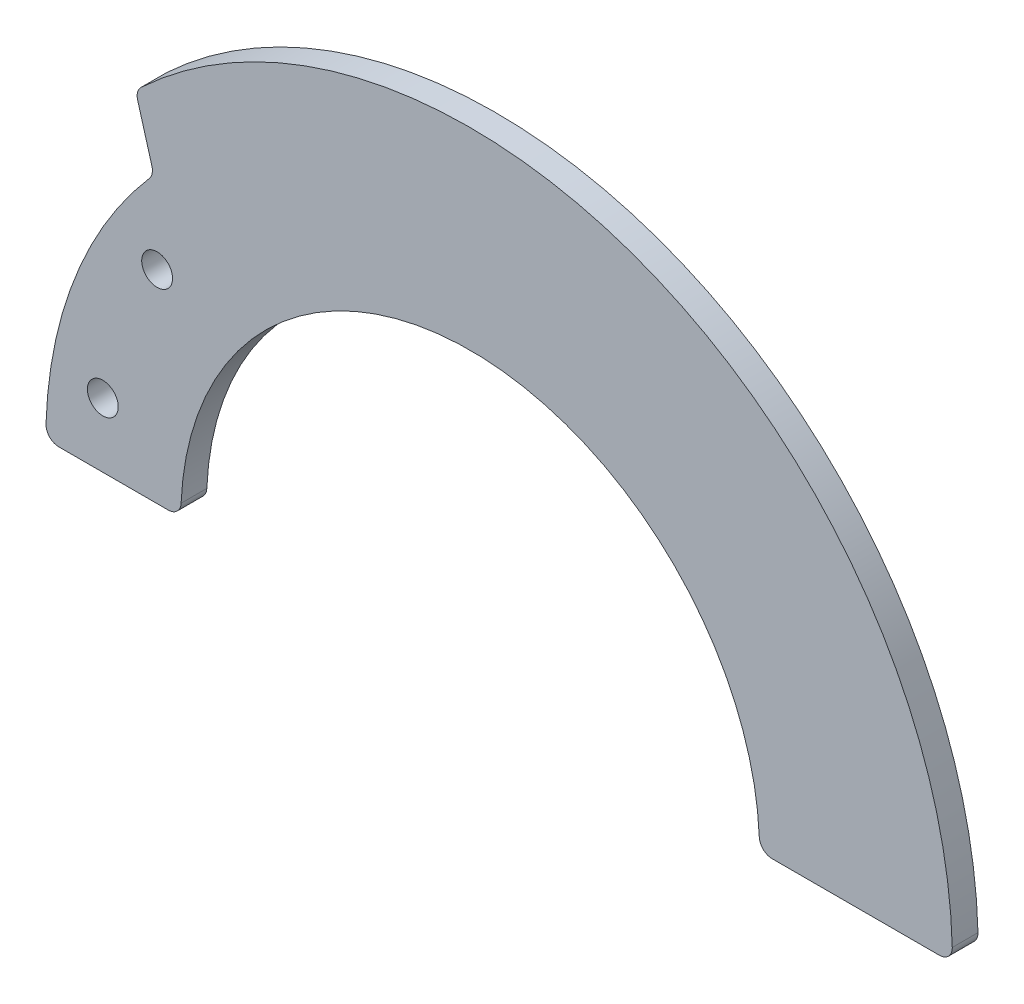
ISO-10303-21;
HEADER;
FILE_DESCRIPTION(('STEP AP214'),'2;1');
FILE_NAME('part.step','',(''),(''),'','','');
FILE_SCHEMA(('AUTOMOTIVE_DESIGN { 1 0 10303 214 1 1 1 1 }'));
ENDSEC;
DATA;
#1=APPLICATION_CONTEXT('core data for automotive mechanical design processes');
#2=APPLICATION_PROTOCOL_DEFINITION('international standard','automotive_design',2000,#1);
#3=PRODUCT_CONTEXT('',#1,'mechanical');
#4=PRODUCT('Part','Part','',(#3));
#5=PRODUCT_RELATED_PRODUCT_CATEGORY('part','',(#4));
#6=PRODUCT_DEFINITION_FORMATION('','',#4);
#7=PRODUCT_DEFINITION_CONTEXT('part definition',#1,'design');
#8=PRODUCT_DEFINITION('design','',#6,#7);
#9=PRODUCT_DEFINITION_SHAPE('','',#8);
#10=(LENGTH_UNIT() NAMED_UNIT(*) SI_UNIT(.MILLI.,.METRE.));
#11=(NAMED_UNIT(*) PLANE_ANGLE_UNIT() SI_UNIT($,.RADIAN.));
#12=(NAMED_UNIT(*) SI_UNIT($,.STERADIAN.) SOLID_ANGLE_UNIT());
#13=UNCERTAINTY_MEASURE_WITH_UNIT(LENGTH_MEASURE(1.E-05),#10,'distance_accuracy_value','');
#14=(GEOMETRIC_REPRESENTATION_CONTEXT(3) GLOBAL_UNCERTAINTY_ASSIGNED_CONTEXT((#13)) GLOBAL_UNIT_ASSIGNED_CONTEXT((#10,
#11,#12)) REPRESENTATION_CONTEXT('',''));
#15=CARTESIAN_POINT('',(0.,0.,0.));
#16=DIRECTION('',(0.,0.,1.));
#17=DIRECTION('',(1.,0.,0.));
#18=AXIS2_PLACEMENT_3D('',#15,#16,#17);
#19=CARTESIAN_POINT('',(0.,0.,2.));
#20=DIRECTION('',(0.,0.,-1.));
#21=DIRECTION('',(-1.,0.,0.));
#22=AXIS2_PLACEMENT_3D('',#19,#20,#21);
#23=CYLINDRICAL_SURFACE('',#22,22.5);
#24=CARTESIAN_POINT('',(0.,0.,0.));
#25=DIRECTION('',(0.,0.,-1.));
#26=DIRECTION('',(1.,0.,0.));
#27=AXIS2_PLACEMENT_3D('',#24,#25,#26);
#28=CIRCLE('',#27,22.5);
#29=CARTESIAN_POINT('',(-22.4796195610351,0.957446808510638,0.));
#30=VERTEX_POINT('',#29);
#31=CARTESIAN_POINT('',(22.4796195610351,0.957446808510638,0.));
#32=VERTEX_POINT('',#31);
#33=EDGE_CURVE('E154',#30,#32,#28,.T.);
#34=ORIENTED_EDGE('',*,*,#33,.T.);
#35=DIRECTION('',(0.,0.,-1.));
#36=VECTOR('',#35,1.);
#37=CARTESIAN_POINT('',(22.4796195610351,0.957446808510638,2.));
#38=LINE('',#37,#36);
#39=CARTESIAN_POINT('',(22.4796195610351,0.957446808510638,2.));
#40=VERTEX_POINT('',#39);
#41=EDGE_CURVE('E181',#32,#40,#38,.F.);
#42=ORIENTED_EDGE('',*,*,#41,.T.);
#43=CARTESIAN_POINT('',(0.,0.,2.));
#44=DIRECTION('',(0.,0.,-1.));
#45=DIRECTION('',(1.,0.,0.));
#46=AXIS2_PLACEMENT_3D('',#43,#44,#45);
#47=CIRCLE('',#46,22.5);
#48=CARTESIAN_POINT('',(-22.4796195610351,0.957446808510638,2.));
#49=VERTEX_POINT('',#48);
#50=EDGE_CURVE('E152',#49,#40,#47,.T.);
#51=ORIENTED_EDGE('',*,*,#50,.F.);
#52=DIRECTION('',(0.,0.,-1.));
#53=VECTOR('',#52,1.);
#54=CARTESIAN_POINT('',(-22.4796195610351,0.957446808510638,2.));
#55=LINE('',#54,#53);
#56=EDGE_CURVE('E178',#49,#30,#55,.T.);
#57=ORIENTED_EDGE('',*,*,#56,.T.);
#58=EDGE_LOOP('',(#34,#42,#51,#57));
#59=FACE_BOUND('',#58,.T.);
#60=ADVANCED_FACE('F32',(#59),#23,.F.);
#61=CARTESIAN_POINT('',(22.5,0.,2.));
#62=DIRECTION('',(0.,1.,0.));
#63=DIRECTION('',(-1.,0.,0.));
#64=AXIS2_PLACEMENT_3D('',#61,#62,#63);
#65=PLANE('',#64);
#66=DIRECTION('',(1.,0.,0.));
#67=VECTOR('',#66,1.);
#68=CARTESIAN_POINT('',(22.5,0.,0.));
#69=LINE('',#68,#67);
#70=CARTESIAN_POINT('',(23.4787137637478,0.,0.));
#71=VERTEX_POINT('',#70);
#72=CARTESIAN_POINT('',(36.4862987983161,0.,0.));
#73=VERTEX_POINT('',#72);
#74=EDGE_CURVE('E149',#71,#73,#69,.T.);
#75=ORIENTED_EDGE('',*,*,#74,.T.);
#76=DIRECTION('',(0.,0.,-1.));
#77=VECTOR('',#76,1.);
#78=CARTESIAN_POINT('',(36.4862987983161,0.,2.));
#79=LINE('',#78,#77);
#80=CARTESIAN_POINT('',(36.4862987983161,0.,2.));
#81=VERTEX_POINT('',#80);
#82=EDGE_CURVE('E126',#73,#81,#79,.F.);
#83=ORIENTED_EDGE('',*,*,#82,.T.);
#84=DIRECTION('',(1.,0.,0.));
#85=VECTOR('',#84,1.);
#86=CARTESIAN_POINT('',(22.5,0.,2.));
#87=LINE('',#86,#85);
#88=CARTESIAN_POINT('',(23.4787137637478,0.,2.));
#89=VERTEX_POINT('',#88);
#90=EDGE_CURVE('E232',#89,#81,#87,.T.);
#91=ORIENTED_EDGE('',*,*,#90,.F.);
#92=DIRECTION('',(0.,0.,-1.));
#93=VECTOR('',#92,1.);
#94=CARTESIAN_POINT('',(23.4787137637478,0.,2.));
#95=LINE('',#94,#93);
#96=EDGE_CURVE('E131',#89,#71,#95,.T.);
#97=ORIENTED_EDGE('',*,*,#96,.T.);
#98=EDGE_LOOP('',(#75,#83,#91,#97));
#99=FACE_BOUND('',#98,.T.);
#100=ADVANCED_FACE('F248',(#99),#65,.F.);
#101=CARTESIAN_POINT('',(0.,0.,2.));
#102=DIRECTION('',(0.,0.,-1.));
#103=DIRECTION('',(-1.,0.,0.));
#104=AXIS2_PLACEMENT_3D('',#101,#102,#103);
#105=CYLINDRICAL_SURFACE('',#104,37.5);
#106=CARTESIAN_POINT('',(0.,0.,2.));
#107=DIRECTION('',(0.,0.,1.));
#108=DIRECTION('',(1.,0.,0.));
#109=AXIS2_PLACEMENT_3D('',#106,#107,#108);
#110=CIRCLE('',#109,37.5);
#111=CARTESIAN_POINT('',(37.4859234229275,1.02739726027397,2.));
#112=VERTEX_POINT('',#111);
#113=CARTESIAN_POINT('',(-25.5781110459493,27.422805022847,2.));
#114=VERTEX_POINT('',#113);
#115=EDGE_CURVE('E141',#112,#114,#110,.T.);
#116=ORIENTED_EDGE('',*,*,#115,.F.);
#117=DIRECTION('',(0.,0.,-1.));
#118=VECTOR('',#117,1.);
#119=CARTESIAN_POINT('',(37.4859234229275,1.02739726027397,2.));
#120=LINE('',#119,#118);
#121=CARTESIAN_POINT('',(37.4859234229275,1.02739726027397,0.));
#122=VERTEX_POINT('',#121);
#123=EDGE_CURVE('E125',#112,#122,#120,.T.);
#124=ORIENTED_EDGE('',*,*,#123,.T.);
#125=CARTESIAN_POINT('',(0.,0.,0.));
#126=DIRECTION('',(0.,0.,1.));
#127=DIRECTION('',(1.,0.,0.));
#128=AXIS2_PLACEMENT_3D('',#125,#126,#127);
#129=CIRCLE('',#128,37.5);
#130=CARTESIAN_POINT('',(-25.5781110459493,27.422805022847,0.));
#131=VERTEX_POINT('',#130);
#132=EDGE_CURVE('E139',#122,#131,#129,.T.);
#133=ORIENTED_EDGE('',*,*,#132,.T.);
#134=DIRECTION('',(0.,0.,-1.));
#135=VECTOR('',#134,1.);
#136=CARTESIAN_POINT('',(-25.5781110459493,27.422805022847,2.));
#137=LINE('',#136,#135);
#138=EDGE_CURVE('E143',#131,#114,#137,.F.);
#139=ORIENTED_EDGE('',*,*,#138,.T.);
#140=EDGE_LOOP('',(#116,#124,#133,#139));
#141=FACE_BOUND('',#140,.T.);
#142=ADVANCED_FACE('F137',(#141),#105,.T.);
#143=CARTESIAN_POINT('',(-22.5,0.,2.));
#144=DIRECTION('',(0.,1.,0.));
#145=DIRECTION('',(-1.,0.,0.));
#146=AXIS2_PLACEMENT_3D('',#143,#144,#145);
#147=PLANE('',#146);
#148=DIRECTION('',(1.,0.,0.));
#149=VECTOR('',#148,1.);
#150=CARTESIAN_POINT('',(-22.5,0.,0.));
#151=LINE('',#150,#149);
#152=CARTESIAN_POINT('',(-31.9843711834389,0.,0.));
#153=VERTEX_POINT('',#152);
#154=CARTESIAN_POINT('',(-23.4787137637478,0.,0.));
#155=VERTEX_POINT('',#154);
#156=EDGE_CURVE('E148',#153,#155,#151,.T.);
#157=ORIENTED_EDGE('',*,*,#156,.T.);
#158=DIRECTION('',(0.,0.,-1.));
#159=VECTOR('',#158,1.);
#160=CARTESIAN_POINT('',(-23.4787137637478,0.,2.));
#161=LINE('',#160,#159);
#162=CARTESIAN_POINT('',(-23.4787137637478,0.,2.));
#163=VERTEX_POINT('',#162);
#164=EDGE_CURVE('E185',#155,#163,#161,.F.);
#165=ORIENTED_EDGE('',*,*,#164,.T.);
#166=DIRECTION('',(1.,0.,0.));
#167=VECTOR('',#166,1.);
#168=CARTESIAN_POINT('',(-22.5,0.,2.));
#169=LINE('',#168,#167);
#170=CARTESIAN_POINT('',(-31.9843711834389,0.,2.));
#171=VERTEX_POINT('',#170);
#172=EDGE_CURVE('E158',#171,#163,#169,.T.);
#173=ORIENTED_EDGE('',*,*,#172,.F.);
#174=DIRECTION('',(0.,0.,1.));
#175=VECTOR('',#174,1.);
#176=CARTESIAN_POINT('',(-31.9843711834389,0.,2.));
#177=LINE('',#176,#175);
#178=EDGE_CURVE('E183',#171,#153,#177,.F.);
#179=ORIENTED_EDGE('',*,*,#178,.T.);
#180=EDGE_LOOP('',(#157,#165,#173,#179));
#181=FACE_BOUND('',#180,.T.);
#182=ADVANCED_FACE('F255',(#181),#147,.F.);
#183=CARTESIAN_POINT('',(0.,0.,2.));
#184=DIRECTION('',(0.,0.,1.));
#185=DIRECTION('',(1.,0.,0.));
#186=AXIS2_PLACEMENT_3D('',#183,#184,#185);
#187=PLANE('',#186);
#188=ORIENTED_EDGE('',*,*,#90,.T.);
#189=CARTESIAN_POINT('',(36.4862987983161,0.999999999999998,2.));
#190=DIRECTION('',(0.,0.,1.));
#191=DIRECTION('',(1.,0.,0.));
#192=AXIS2_PLACEMENT_3D('',#189,#190,#191);
#193=CIRCLE('',#192,1.);
#194=EDGE_CURVE('E176',#81,#112,#193,.T.);
#195=ORIENTED_EDGE('',*,*,#194,.T.);
#196=ORIENTED_EDGE('',*,*,#115,.T.);
#197=CARTESIAN_POINT('',(-24.896028084724,26.6915302222378,2.));
#198=DIRECTION('',(0.,0.,1.));
#199=DIRECTION('',(1.,0.,0.));
#200=AXIS2_PLACEMENT_3D('',#197,#198,#199);
#201=CIRCLE('',#200,1.);
#202=CARTESIAN_POINT('',(-25.8576176307105,26.4170387924087,2.));
#203=VERTEX_POINT('',#202);
#204=EDGE_CURVE('E47',#114,#203,#201,.T.);
#205=ORIENTED_EDGE('',*,*,#204,.T.);
#206=DIRECTION('',(-0.274491429829036,0.961589545986442,0.));
#207=VECTOR('',#206,1.);
#208=CARTESIAN_POINT('',(-24.5967477524977,22.,2.));
#209=LINE('',#208,#207);
#210=CARTESIAN_POINT('',(-24.746627720225,22.5250546809754,2.));
#211=VERTEX_POINT('',#210);
#212=EDGE_CURVE('E201',#211,#203,#209,.T.);
#213=ORIENTED_EDGE('',*,*,#212,.F.);
#214=CARTESIAN_POINT('',(-25.7082172662115,22.2505632511464,2.));
#215=DIRECTION('',(0.,0.,1.));
#216=DIRECTION('',(1.,0.,0.));
#217=AXIS2_PLACEMENT_3D('',#214,#215,#216);
#218=CIRCLE('',#217,1.);
#219=CARTESIAN_POINT('',(-24.9520932289699,21.5961349202303,2.));
#220=VERTEX_POINT('',#219);
#221=EDGE_CURVE('E40',#211,#220,#218,.F.);
#222=ORIENTED_EDGE('',*,*,#221,.T.);
#223=CARTESIAN_POINT('',(0.,0.,2.));
#224=DIRECTION('',(0.,0.,-1.));
#225=DIRECTION('',(-1.,0.,0.));
#226=AXIS2_PLACEMENT_3D('',#223,#224,#225);
#227=CIRCLE('',#226,33.);
#228=CARTESIAN_POINT('',(-32.9838827829214,1.03125,2.));
#229=VERTEX_POINT('',#228);
#230=EDGE_CURVE('E200',#229,#220,#227,.T.);
#231=ORIENTED_EDGE('',*,*,#230,.F.);
#232=CARTESIAN_POINT('',(-31.9843711834389,0.999999999999999,2.));
#233=DIRECTION('',(0.,0.,1.));
#234=DIRECTION('',(1.,0.,0.));
#235=AXIS2_PLACEMENT_3D('',#232,#233,#234);
#236=CIRCLE('',#235,1.);
#237=EDGE_CURVE('E170',#229,#171,#236,.T.);
#238=ORIENTED_EDGE('',*,*,#237,.T.);
#239=ORIENTED_EDGE('',*,*,#172,.T.);
#240=CARTESIAN_POINT('',(-23.4787137637478,1.,2.));
#241=DIRECTION('',(0.,0.,1.));
#242=DIRECTION('',(1.,0.,0.));
#243=AXIS2_PLACEMENT_3D('',#240,#241,#242);
#244=CIRCLE('',#243,1.);
#245=EDGE_CURVE('E172',#163,#49,#244,.T.);
#246=ORIENTED_EDGE('',*,*,#245,.T.);
#247=ORIENTED_EDGE('',*,*,#50,.T.);
#248=CARTESIAN_POINT('',(23.4787137637478,1.,2.));
#249=DIRECTION('',(0.,0.,1.));
#250=DIRECTION('',(1.,0.,0.));
#251=AXIS2_PLACEMENT_3D('',#248,#249,#250);
#252=CIRCLE('',#251,1.);
#253=EDGE_CURVE('E174',#40,#89,#252,.T.);
#254=ORIENTED_EDGE('',*,*,#253,.T.);
#255=EDGE_LOOP('',(#188,#195,#196,#205,#213,#222,#231,#238,#239,#246,#247,#254));
#256=FACE_BOUND('',#255,.T.);
#257=CARTESIAN_POINT('',(-28.5657137141714,5.,2.));
#258=DIRECTION('',(0.,0.,1.));
#259=DIRECTION('',(1.,0.,0.));
#260=AXIS2_PLACEMENT_3D('',#257,#258,#259);
#261=CIRCLE('',#260,1.2);
#262=CARTESIAN_POINT('',(-27.3657137141714,5.,2.));
#263=VERTEX_POINT('',#262);
#264=EDGE_CURVE('E215',#263,#263,#261,.T.);
#265=ORIENTED_EDGE('',*,*,#264,.F.);
#266=EDGE_LOOP('',(#265));
#267=FACE_BOUND('',#266,.T.);
#268=CARTESIAN_POINT('',(-24.3430751807364,15.7611766929063,2.));
#269=DIRECTION('',(0.,0.,1.));
#270=DIRECTION('',(1.,0.,0.));
#271=AXIS2_PLACEMENT_3D('',#268,#269,#270);
#272=CIRCLE('',#271,1.2);
#273=CARTESIAN_POINT('',(-23.1430751807364,15.7611766929063,2.));
#274=VERTEX_POINT('',#273);
#275=EDGE_CURVE('E224',#274,#274,#272,.T.);
#276=ORIENTED_EDGE('',*,*,#275,.F.);
#277=EDGE_LOOP('',(#276));
#278=FACE_BOUND('',#277,.T.);
#279=ADVANCED_FACE('F198',(#256,#267,#278),#187,.T.);
#280=CARTESIAN_POINT('',(0.,0.,0.));
#281=DIRECTION('',(0.,0.,1.));
#282=DIRECTION('',(1.,0.,0.));
#283=AXIS2_PLACEMENT_3D('',#280,#281,#282);
#284=PLANE('',#283);
#285=CARTESIAN_POINT('',(-28.5657137141714,5.,0.));
#286=DIRECTION('',(0.,0.,1.));
#287=DIRECTION('',(1.,0.,0.));
#288=AXIS2_PLACEMENT_3D('',#285,#286,#287);
#289=CIRCLE('',#288,1.2);
#290=CARTESIAN_POINT('',(-27.3657137141714,5.,0.));
#291=VERTEX_POINT('',#290);
#292=EDGE_CURVE('E218',#291,#291,#289,.T.);
#293=ORIENTED_EDGE('',*,*,#292,.T.);
#294=EDGE_LOOP('',(#293));
#295=FACE_BOUND('',#294,.T.);
#296=CARTESIAN_POINT('',(-24.3430751807364,15.7611766929063,0.));
#297=DIRECTION('',(0.,0.,1.));
#298=DIRECTION('',(1.,0.,0.));
#299=AXIS2_PLACEMENT_3D('',#296,#297,#298);
#300=CIRCLE('',#299,1.2);
#301=CARTESIAN_POINT('',(-23.1430751807364,15.7611766929063,0.));
#302=VERTEX_POINT('',#301);
#303=EDGE_CURVE('E227',#302,#302,#300,.T.);
#304=ORIENTED_EDGE('',*,*,#303,.T.);
#305=EDGE_LOOP('',(#304));
#306=FACE_BOUND('',#305,.T.);
#307=ORIENTED_EDGE('',*,*,#132,.F.);
#308=CARTESIAN_POINT('',(36.4862987983161,0.999999999999998,0.));
#309=DIRECTION('',(0.,0.,1.));
#310=DIRECTION('',(1.,0.,0.));
#311=AXIS2_PLACEMENT_3D('',#308,#309,#310);
#312=CIRCLE('',#311,1.);
#313=EDGE_CURVE('E121',#122,#73,#312,.F.);
#314=ORIENTED_EDGE('',*,*,#313,.T.);
#315=ORIENTED_EDGE('',*,*,#74,.F.);
#316=CARTESIAN_POINT('',(23.4787137637478,1.,0.));
#317=DIRECTION('',(0.,0.,1.));
#318=DIRECTION('',(1.,0.,0.));
#319=AXIS2_PLACEMENT_3D('',#316,#317,#318);
#320=CIRCLE('',#319,1.);
#321=EDGE_CURVE('E132',#71,#32,#320,.F.);
#322=ORIENTED_EDGE('',*,*,#321,.T.);
#323=ORIENTED_EDGE('',*,*,#33,.F.);
#324=CARTESIAN_POINT('',(-23.4787137637478,1.,0.));
#325=DIRECTION('',(0.,0.,1.));
#326=DIRECTION('',(1.,0.,0.));
#327=AXIS2_PLACEMENT_3D('',#324,#325,#326);
#328=CIRCLE('',#327,1.);
#329=EDGE_CURVE('E163',#30,#155,#328,.F.);
#330=ORIENTED_EDGE('',*,*,#329,.T.);
#331=ORIENTED_EDGE('',*,*,#156,.F.);
#332=CARTESIAN_POINT('',(-31.9843711834389,0.999999999999999,0.));
#333=DIRECTION('',(0.,0.,1.));
#334=DIRECTION('',(1.,0.,0.));
#335=AXIS2_PLACEMENT_3D('',#332,#333,#334);
#336=CIRCLE('',#335,1.);
#337=CARTESIAN_POINT('',(-32.9838827829214,1.03125,0.));
#338=VERTEX_POINT('',#337);
#339=EDGE_CURVE('E161',#153,#338,#336,.F.);
#340=ORIENTED_EDGE('',*,*,#339,.T.);
#341=CARTESIAN_POINT('',(0.,0.,0.));
#342=DIRECTION('',(0.,0.,1.));
#343=DIRECTION('',(1.,0.,0.));
#344=AXIS2_PLACEMENT_3D('',#341,#342,#343);
#345=CIRCLE('',#344,33.);
#346=CARTESIAN_POINT('',(-24.9520932289699,21.5961349202303,0.));
#347=VERTEX_POINT('',#346);
#348=EDGE_CURVE('E207',#347,#338,#345,.T.);
#349=ORIENTED_EDGE('',*,*,#348,.F.);
#350=CARTESIAN_POINT('',(-25.7082172662115,22.2505632511464,0.));
#351=DIRECTION('',(0.,0.,1.));
#352=DIRECTION('',(1.,0.,0.));
#353=AXIS2_PLACEMENT_3D('',#350,#351,#352);
#354=CIRCLE('',#353,1.);
#355=CARTESIAN_POINT('',(-24.746627720225,22.5250546809754,0.));
#356=VERTEX_POINT('',#355);
#357=EDGE_CURVE('E11',#347,#356,#354,.T.);
#358=ORIENTED_EDGE('',*,*,#357,.T.);
#359=DIRECTION('',(0.274491429829036,-0.961589545986442,0.));
#360=VECTOR('',#359,1.);
#361=CARTESIAN_POINT('',(-24.5967477524977,22.,0.));
#362=LINE('',#361,#360);
#363=CARTESIAN_POINT('',(-25.8576176307105,26.4170387924087,0.));
#364=VERTEX_POINT('',#363);
#365=EDGE_CURVE('E211',#364,#356,#362,.T.);
#366=ORIENTED_EDGE('',*,*,#365,.F.);
#367=CARTESIAN_POINT('',(-24.896028084724,26.6915302222378,0.));
#368=DIRECTION('',(0.,0.,1.));
#369=DIRECTION('',(1.,0.,0.));
#370=AXIS2_PLACEMENT_3D('',#367,#368,#369);
#371=CIRCLE('',#370,1.);
#372=EDGE_CURVE('E142',#364,#131,#371,.F.);
#373=ORIENTED_EDGE('',*,*,#372,.T.);
#374=EDGE_LOOP('',(#307,#314,#315,#322,#323,#330,#331,#340,#349,#358,#366,#373));
#375=FACE_BOUND('',#374,.T.);
#376=ADVANCED_FACE('F145',(#295,#306,#375),#284,.F.);
#377=CARTESIAN_POINT('',(-24.3430751807364,15.7611766929063,2.));
#378=DIRECTION('',(0.,0.,1.));
#379=DIRECTION('',(1.,0.,0.));
#380=AXIS2_PLACEMENT_3D('',#377,#378,#379);
#381=CYLINDRICAL_SURFACE('',#380,1.2);
#382=ORIENTED_EDGE('',*,*,#275,.T.);
#383=EDGE_LOOP('',(#382));
#384=FACE_BOUND('',#383,.T.);
#385=ORIENTED_EDGE('',*,*,#303,.F.);
#386=EDGE_LOOP('',(#385));
#387=FACE_BOUND('',#386,.T.);
#388=ADVANCED_FACE('F335',(#384,#387),#381,.F.);
#389=CARTESIAN_POINT('',(-28.5657137141714,5.,2.));
#390=DIRECTION('',(0.,0.,1.));
#391=DIRECTION('',(1.,0.,0.));
#392=AXIS2_PLACEMENT_3D('',#389,#390,#391);
#393=CYLINDRICAL_SURFACE('',#392,1.2);
#394=ORIENTED_EDGE('',*,*,#264,.T.);
#395=EDGE_LOOP('',(#394));
#396=FACE_BOUND('',#395,.T.);
#397=ORIENTED_EDGE('',*,*,#292,.F.);
#398=EDGE_LOOP('',(#397));
#399=FACE_BOUND('',#398,.T.);
#400=ADVANCED_FACE('F324',(#396,#399),#393,.F.);
#401=CARTESIAN_POINT('',(0.,0.,-0.00100000000000013));
#402=DIRECTION('',(0.,0.,1.));
#403=DIRECTION('',(1.,0.,0.));
#404=AXIS2_PLACEMENT_3D('',#401,#402,#403);
#405=CYLINDRICAL_SURFACE('',#404,33.);
#406=ORIENTED_EDGE('',*,*,#348,.T.);
#407=DIRECTION('',(0.,0.,1.));
#408=VECTOR('',#407,1.);
#409=CARTESIAN_POINT('',(-32.9838827829214,1.03125,-0.00100000000000013));
#410=LINE('',#409,#408);
#411=EDGE_CURVE('E189',#338,#229,#410,.T.);
#412=ORIENTED_EDGE('',*,*,#411,.T.);
#413=ORIENTED_EDGE('',*,*,#230,.T.);
#414=DIRECTION('',(0.,0.,1.));
#415=VECTOR('',#414,1.);
#416=CARTESIAN_POINT('',(-24.9520932289699,21.5961349202303,-0.00100000000000013));
#417=LINE('',#416,#415);
#418=EDGE_CURVE('E187',#220,#347,#417,.F.);
#419=ORIENTED_EDGE('',*,*,#418,.T.);
#420=EDGE_LOOP('',(#406,#412,#413,#419));
#421=FACE_BOUND('',#420,.T.);
#422=ADVANCED_FACE('F204',(#421),#405,.T.);
#423=CARTESIAN_POINT('',(-24.5967477524977,22.,-0.00100000000000013));
#424=DIRECTION('',(0.961589545986442,0.274491429829036,0.));
#425=DIRECTION('',(-0.274491429829036,0.961589545986442,0.));
#426=AXIS2_PLACEMENT_3D('',#423,#424,#425);
#427=PLANE('',#426);
#428=ORIENTED_EDGE('',*,*,#212,.T.);
#429=DIRECTION('',(0.,0.,-1.));
#430=VECTOR('',#429,1.);
#431=CARTESIAN_POINT('',(-25.8576176307105,26.4170387924087,-0.00100000000000013));
#432=LINE('',#431,#430);
#433=EDGE_CURVE('E194',#203,#364,#432,.T.);
#434=ORIENTED_EDGE('',*,*,#433,.T.);
#435=ORIENTED_EDGE('',*,*,#365,.T.);
#436=DIRECTION('',(0.,0.,-1.));
#437=VECTOR('',#436,1.);
#438=CARTESIAN_POINT('',(-24.746627720225,22.5250546809754,2.));
#439=LINE('',#438,#437);
#440=EDGE_CURVE('E192',#356,#211,#439,.F.);
#441=ORIENTED_EDGE('',*,*,#440,.T.);
#442=EDGE_LOOP('',(#428,#434,#435,#441));
#443=FACE_BOUND('',#442,.T.);
#444=ADVANCED_FACE('F213',(#443),#427,.F.);
#445=CARTESIAN_POINT('',(36.4862987983161,0.999999999999998,2.));
#446=DIRECTION('',(0.,0.,-1.));
#447=DIRECTION('',(-1.,0.,0.));
#448=AXIS2_PLACEMENT_3D('',#445,#446,#447);
#449=CYLINDRICAL_SURFACE('',#448,1.);
#450=ORIENTED_EDGE('',*,*,#194,.F.);
#451=ORIENTED_EDGE('',*,*,#82,.F.);
#452=ORIENTED_EDGE('',*,*,#313,.F.);
#453=ORIENTED_EDGE('',*,*,#123,.F.);
#454=EDGE_LOOP('',(#450,#451,#452,#453));
#455=FACE_BOUND('',#454,.T.);
#456=ADVANCED_FACE('F124',(#455),#449,.T.);
#457=CARTESIAN_POINT('',(23.4787137637478,1.,2.));
#458=DIRECTION('',(0.,0.,-1.));
#459=DIRECTION('',(-1.,0.,0.));
#460=AXIS2_PLACEMENT_3D('',#457,#458,#459);
#461=CYLINDRICAL_SURFACE('',#460,1.);
#462=ORIENTED_EDGE('',*,*,#253,.F.);
#463=ORIENTED_EDGE('',*,*,#41,.F.);
#464=ORIENTED_EDGE('',*,*,#321,.F.);
#465=ORIENTED_EDGE('',*,*,#96,.F.);
#466=EDGE_LOOP('',(#462,#463,#464,#465));
#467=FACE_BOUND('',#466,.T.);
#468=ADVANCED_FACE('F244',(#467),#461,.T.);
#469=CARTESIAN_POINT('',(-23.4787137637478,1.,2.));
#470=DIRECTION('',(0.,0.,-1.));
#471=DIRECTION('',(-1.,0.,0.));
#472=AXIS2_PLACEMENT_3D('',#469,#470,#471);
#473=CYLINDRICAL_SURFACE('',#472,1.);
#474=ORIENTED_EDGE('',*,*,#245,.F.);
#475=ORIENTED_EDGE('',*,*,#164,.F.);
#476=ORIENTED_EDGE('',*,*,#329,.F.);
#477=ORIENTED_EDGE('',*,*,#56,.F.);
#478=EDGE_LOOP('',(#474,#475,#476,#477));
#479=FACE_BOUND('',#478,.T.);
#480=ADVANCED_FACE('F264',(#479),#473,.T.);
#481=CARTESIAN_POINT('',(-31.9843711834389,0.999999999999999,-0.00100000000000013));
#482=DIRECTION('',(0.,0.,1.));
#483=DIRECTION('',(1.,0.,0.));
#484=AXIS2_PLACEMENT_3D('',#481,#482,#483);
#485=CYLINDRICAL_SURFACE('',#484,1.);
#486=ORIENTED_EDGE('',*,*,#339,.F.);
#487=ORIENTED_EDGE('',*,*,#178,.F.);
#488=ORIENTED_EDGE('',*,*,#237,.F.);
#489=ORIENTED_EDGE('',*,*,#411,.F.);
#490=EDGE_LOOP('',(#486,#487,#488,#489));
#491=FACE_BOUND('',#490,.T.);
#492=ADVANCED_FACE('F267',(#491),#485,.T.);
#493=CARTESIAN_POINT('',(-24.896028084724,26.6915302222378,2.));
#494=DIRECTION('',(0.,0.,-1.));
#495=DIRECTION('',(-1.,0.,0.));
#496=AXIS2_PLACEMENT_3D('',#493,#494,#495);
#497=CYLINDRICAL_SURFACE('',#496,1.);
#498=ORIENTED_EDGE('',*,*,#372,.F.);
#499=ORIENTED_EDGE('',*,*,#433,.F.);
#500=ORIENTED_EDGE('',*,*,#204,.F.);
#501=ORIENTED_EDGE('',*,*,#138,.F.);
#502=EDGE_LOOP('',(#498,#499,#500,#501));
#503=FACE_BOUND('',#502,.T.);
#504=ADVANCED_FACE('F270',(#503),#497,.T.);
#505=CARTESIAN_POINT('',(-25.7082172662115,22.2505632511464,-0.00100000000000013));
#506=DIRECTION('',(0.,0.,1.));
#507=DIRECTION('',(1.,0.,0.));
#508=AXIS2_PLACEMENT_3D('',#505,#506,#507);
#509=CYLINDRICAL_SURFACE('',#508,1.);
#510=ORIENTED_EDGE('',*,*,#357,.F.);
#511=ORIENTED_EDGE('',*,*,#418,.F.);
#512=ORIENTED_EDGE('',*,*,#221,.F.);
#513=ORIENTED_EDGE('',*,*,#440,.F.);
#514=EDGE_LOOP('',(#510,#511,#512,#513));
#515=FACE_BOUND('',#514,.T.);
#516=ADVANCED_FACE('F34',(#515),#509,.F.);
#517=CLOSED_SHELL('',(#60,#100,#142,#182,#279,#376,#388,#400,#422,#444,#456,#468,#480,#492,#504,#516));
#518=MANIFOLD_SOLID_BREP('B2',#517);
#519=ADVANCED_BREP_SHAPE_REPRESENTATION('',(#18,#518),#14);
#520=SHAPE_DEFINITION_REPRESENTATION(#9,#519);
ENDSEC;
END-ISO-10303-21;
